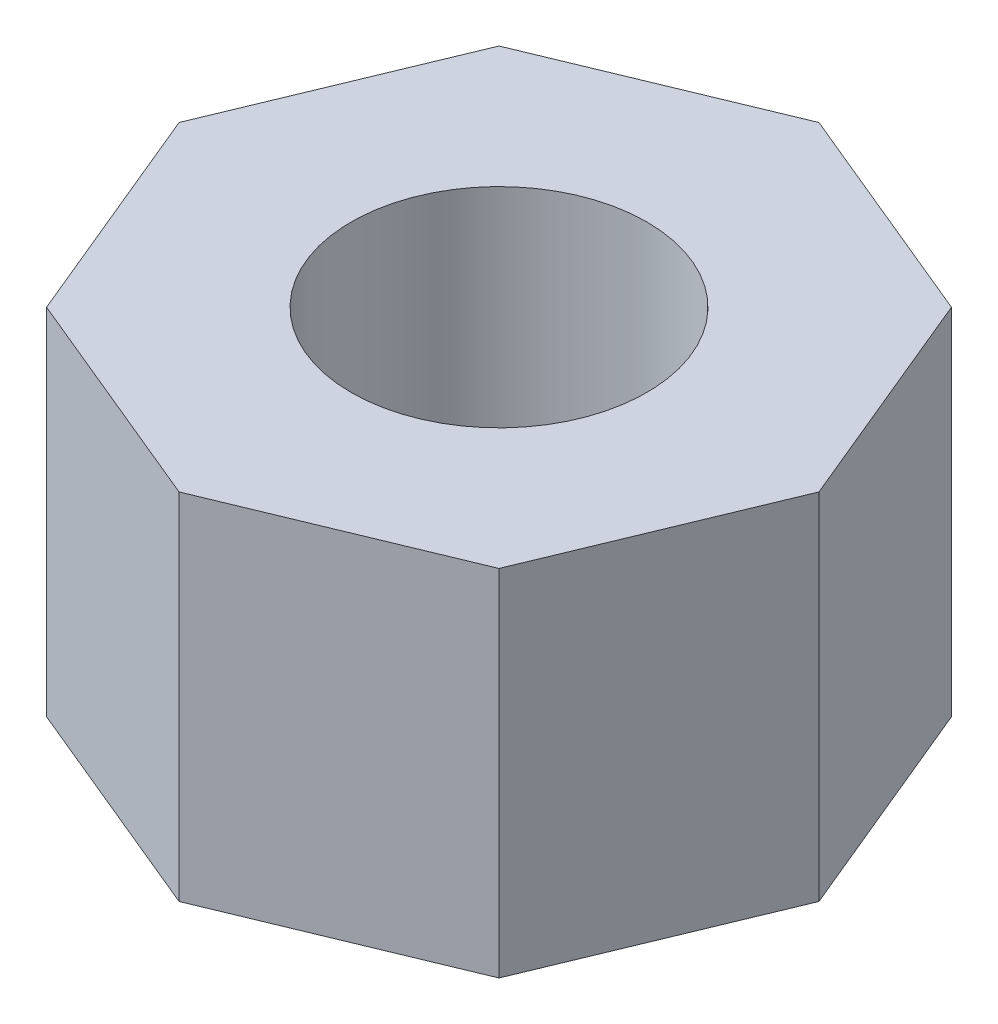
ISO-10303-21;
HEADER;
FILE_DESCRIPTION(('STEP AP214'),'2;1');
FILE_NAME('part.step','',(''),(''),'','','');
FILE_SCHEMA(('AUTOMOTIVE_DESIGN { 1 0 10303 214 1 1 1 1 }'));
ENDSEC;
DATA;
#1=APPLICATION_CONTEXT('core data for automotive mechanical design processes');
#2=APPLICATION_PROTOCOL_DEFINITION('international standard','automotive_design',2000,#1);
#3=PRODUCT_CONTEXT('',#1,'mechanical');
#4=PRODUCT('Part','Part','',(#3));
#5=PRODUCT_RELATED_PRODUCT_CATEGORY('part','',(#4));
#6=PRODUCT_DEFINITION_FORMATION('','',#4);
#7=PRODUCT_DEFINITION_CONTEXT('part definition',#1,'design');
#8=PRODUCT_DEFINITION('design','',#6,#7);
#9=PRODUCT_DEFINITION_SHAPE('','',#8);
#10=(LENGTH_UNIT() NAMED_UNIT(*) SI_UNIT(.MILLI.,.METRE.));
#11=(NAMED_UNIT(*) PLANE_ANGLE_UNIT() SI_UNIT($,.RADIAN.));
#12=(NAMED_UNIT(*) SI_UNIT($,.STERADIAN.) SOLID_ANGLE_UNIT());
#13=UNCERTAINTY_MEASURE_WITH_UNIT(LENGTH_MEASURE(1.E-05),#10,'distance_accuracy_value','');
#14=(GEOMETRIC_REPRESENTATION_CONTEXT(3) GLOBAL_UNCERTAINTY_ASSIGNED_CONTEXT((#13)) GLOBAL_UNIT_ASSIGNED_CONTEXT((#10,
#11,#12)) REPRESENTATION_CONTEXT('',''));
#15=CARTESIAN_POINT('',(0.,0.,0.));
#16=DIRECTION('',(0.,0.,1.));
#17=DIRECTION('',(1.,0.,0.));
#18=AXIS2_PLACEMENT_3D('',#15,#16,#17);
#19=CARTESIAN_POINT('',(1.9134171618255,6.,4.61939766255641));
#20=DIRECTION('',(-0.382683432365101,0.,-0.923879532511282));
#21=DIRECTION('',(-0.923879532511282,0.,0.382683432365101));
#22=AXIS2_PLACEMENT_3D('',#19,#20,#21);
#23=PLANE('',#22);
#24=DIRECTION('',(0.923879532511282,0.,-0.382683432365101));
#25=VECTOR('',#24,1.);
#26=CARTESIAN_POINT('',(1.9134171618255,0.,4.61939766255641));
#27=LINE('',#26,#25);
#28=CARTESIAN_POINT('',(0.,0.,5.41196100146197));
#29=VERTEX_POINT('',#28);
#30=CARTESIAN_POINT('',(3.82683432365094,0.,3.82683432365086));
#31=VERTEX_POINT('',#30);
#32=EDGE_CURVE('E135',#29,#31,#27,.T.);
#33=ORIENTED_EDGE('',*,*,#32,.T.);
#34=DIRECTION('',(0.,-1.,0.));
#35=VECTOR('',#34,1.);
#36=CARTESIAN_POINT('',(3.82683432365094,6.,3.82683432365086));
#37=LINE('',#36,#35);
#38=CARTESIAN_POINT('',(3.82683432365094,6.,3.82683432365086));
#39=VERTEX_POINT('',#38);
#40=EDGE_CURVE('E11',#39,#31,#37,.T.);
#41=ORIENTED_EDGE('',*,*,#40,.F.);
#42=DIRECTION('',(0.923879532511282,0.,-0.382683432365101));
#43=VECTOR('',#42,1.);
#44=CARTESIAN_POINT('',(1.9134171618255,6.,4.61939766255641));
#45=LINE('',#44,#43);
#46=CARTESIAN_POINT('',(0.,6.,5.41196100146197));
#47=VERTEX_POINT('',#46);
#48=EDGE_CURVE('E181',#47,#39,#45,.T.);
#49=ORIENTED_EDGE('',*,*,#48,.F.);
#50=DIRECTION('',(0.,-1.,0.));
#51=VECTOR('',#50,1.);
#52=CARTESIAN_POINT('',(0.,6.,5.41196100146197));
#53=LINE('',#52,#51);
#54=EDGE_CURVE('E128',#47,#29,#53,.T.);
#55=ORIENTED_EDGE('',*,*,#54,.T.);
#56=EDGE_LOOP('',(#33,#41,#49,#55));
#57=FACE_BOUND('',#56,.T.);
#58=ADVANCED_FACE('F35',(#57),#23,.F.);
#59=CARTESIAN_POINT('',(4.61939766255646,6.,1.9134171618254));
#60=DIRECTION('',(-0.923879532511291,0.,-0.382683432365079));
#61=DIRECTION('',(-0.382683432365079,0.,0.923879532511291));
#62=AXIS2_PLACEMENT_3D('',#59,#60,#61);
#63=PLANE('',#62);
#64=DIRECTION('',(0.382683432365079,0.,-0.923879532511291));
#65=VECTOR('',#64,1.);
#66=CARTESIAN_POINT('',(4.61939766255646,0.,1.9134171618254));
#67=LINE('',#66,#65);
#68=CARTESIAN_POINT('',(5.41196100146197,0.,0.));
#69=VERTEX_POINT('',#68);
#70=EDGE_CURVE('E138',#31,#69,#67,.T.);
#71=ORIENTED_EDGE('',*,*,#70,.T.);
#72=DIRECTION('',(0.,-1.,0.));
#73=VECTOR('',#72,1.);
#74=CARTESIAN_POINT('',(5.41196100146197,6.,0.));
#75=LINE('',#74,#73);
#76=CARTESIAN_POINT('',(5.41196100146197,6.,0.));
#77=VERTEX_POINT('',#76);
#78=EDGE_CURVE('E44',#77,#69,#75,.T.);
#79=ORIENTED_EDGE('',*,*,#78,.F.);
#80=DIRECTION('',(0.382683432365079,0.,-0.923879532511291));
#81=VECTOR('',#80,1.);
#82=CARTESIAN_POINT('',(4.61939766255646,6.,1.9134171618254));
#83=LINE('',#82,#81);
#84=EDGE_CURVE('E95',#39,#77,#83,.T.);
#85=ORIENTED_EDGE('',*,*,#84,.F.);
#86=ORIENTED_EDGE('',*,*,#40,.T.);
#87=EDGE_LOOP('',(#71,#79,#85,#86));
#88=FACE_BOUND('',#87,.T.);
#89=ADVANCED_FACE('F199',(#88),#63,.F.);
#90=CARTESIAN_POINT('',(4.61939766255641,6.,-1.9134171618255));
#91=DIRECTION('',(-0.923879532511282,0.,0.3826834323651));
#92=DIRECTION('',(0.3826834323651,0.,0.923879532511283));
#93=AXIS2_PLACEMENT_3D('',#90,#91,#92);
#94=PLANE('',#93);
#95=DIRECTION('',(-0.3826834323651,0.,-0.923879532511282));
#96=VECTOR('',#95,1.);
#97=CARTESIAN_POINT('',(4.61939766255641,0.,-1.9134171618255));
#98=LINE('',#97,#96);
#99=CARTESIAN_POINT('',(3.82683432365085,0.,-3.82683432365095));
#100=VERTEX_POINT('',#99);
#101=EDGE_CURVE('E140',#69,#100,#98,.T.);
#102=ORIENTED_EDGE('',*,*,#101,.T.);
#103=DIRECTION('',(0.,-1.,0.));
#104=VECTOR('',#103,1.);
#105=CARTESIAN_POINT('',(3.82683432365085,6.,-3.82683432365095));
#106=LINE('',#105,#104);
#107=CARTESIAN_POINT('',(3.82683432365085,6.,-3.82683432365095));
#108=VERTEX_POINT('',#107);
#109=EDGE_CURVE('E156',#108,#100,#106,.T.);
#110=ORIENTED_EDGE('',*,*,#109,.F.);
#111=DIRECTION('',(-0.3826834323651,0.,-0.923879532511282));
#112=VECTOR('',#111,1.);
#113=CARTESIAN_POINT('',(4.61939766255641,6.,-1.9134171618255));
#114=LINE('',#113,#112);
#115=EDGE_CURVE('E164',#77,#108,#114,.T.);
#116=ORIENTED_EDGE('',*,*,#115,.F.);
#117=ORIENTED_EDGE('',*,*,#78,.T.);
#118=EDGE_LOOP('',(#102,#110,#116,#117));
#119=FACE_BOUND('',#118,.T.);
#120=ADVANCED_FACE('F162',(#119),#94,.F.);
#121=CARTESIAN_POINT('',(1.9134171618254,6.,-4.61939766255646));
#122=DIRECTION('',(-0.382683432365079,0.,0.923879532511291));
#123=DIRECTION('',(0.923879532511291,0.,0.382683432365079));
#124=AXIS2_PLACEMENT_3D('',#121,#122,#123);
#125=PLANE('',#124);
#126=DIRECTION('',(-0.923879532511291,0.,-0.382683432365079));
#127=VECTOR('',#126,1.);
#128=CARTESIAN_POINT('',(1.9134171618254,0.,-4.61939766255646));
#129=LINE('',#128,#127);
#130=CARTESIAN_POINT('',(0.,0.,-5.41196100146197));
#131=VERTEX_POINT('',#130);
#132=EDGE_CURVE('E142',#100,#131,#129,.T.);
#133=ORIENTED_EDGE('',*,*,#132,.T.);
#134=DIRECTION('',(0.,-1.,0.));
#135=VECTOR('',#134,1.);
#136=CARTESIAN_POINT('',(0.,6.,-5.41196100146197));
#137=LINE('',#136,#135);
#138=CARTESIAN_POINT('',(0.,6.,-5.41196100146197));
#139=VERTEX_POINT('',#138);
#140=EDGE_CURVE('E153',#139,#131,#137,.T.);
#141=ORIENTED_EDGE('',*,*,#140,.F.);
#142=DIRECTION('',(-0.923879532511291,0.,-0.382683432365079));
#143=VECTOR('',#142,1.);
#144=CARTESIAN_POINT('',(1.9134171618254,6.,-4.61939766255646));
#145=LINE('',#144,#143);
#146=EDGE_CURVE('E176',#108,#139,#145,.T.);
#147=ORIENTED_EDGE('',*,*,#146,.F.);
#148=ORIENTED_EDGE('',*,*,#109,.T.);
#149=EDGE_LOOP('',(#133,#141,#147,#148));
#150=FACE_BOUND('',#149,.T.);
#151=ADVANCED_FACE('F172',(#150),#125,.F.);
#152=CARTESIAN_POINT('',(-1.9134171618255,6.,-4.61939766255641));
#153=DIRECTION('',(0.3826834323651,0.,0.923879532511282));
#154=DIRECTION('',(0.923879532511283,0.,-0.3826834323651));
#155=AXIS2_PLACEMENT_3D('',#152,#153,#154);
#156=PLANE('',#155);
#157=DIRECTION('',(-0.923879532511282,0.,0.3826834323651));
#158=VECTOR('',#157,1.);
#159=CARTESIAN_POINT('',(-1.9134171618255,0.,-4.61939766255641));
#160=LINE('',#159,#158);
#161=CARTESIAN_POINT('',(-3.82683432365094,0.,-3.82683432365086));
#162=VERTEX_POINT('',#161);
#163=EDGE_CURVE('E144',#131,#162,#160,.T.);
#164=ORIENTED_EDGE('',*,*,#163,.T.);
#165=DIRECTION('',(0.,-1.,0.));
#166=VECTOR('',#165,1.);
#167=CARTESIAN_POINT('',(-3.82683432365094,6.,-3.82683432365086));
#168=LINE('',#167,#166);
#169=CARTESIAN_POINT('',(-3.82683432365094,6.,-3.82683432365086));
#170=VERTEX_POINT('',#169);
#171=EDGE_CURVE('E123',#170,#162,#168,.T.);
#172=ORIENTED_EDGE('',*,*,#171,.F.);
#173=DIRECTION('',(-0.923879532511282,0.,0.3826834323651));
#174=VECTOR('',#173,1.);
#175=CARTESIAN_POINT('',(-1.9134171618255,6.,-4.61939766255641));
#176=LINE('',#175,#174);
#177=EDGE_CURVE('E114',#139,#170,#176,.T.);
#178=ORIENTED_EDGE('',*,*,#177,.F.);
#179=ORIENTED_EDGE('',*,*,#140,.T.);
#180=EDGE_LOOP('',(#164,#172,#178,#179));
#181=FACE_BOUND('',#180,.T.);
#182=ADVANCED_FACE('F175',(#181),#156,.F.);
#183=CARTESIAN_POINT('',(-4.61939766255646,6.,-1.9134171618254));
#184=DIRECTION('',(0.923879532511291,0.,0.382683432365079));
#185=DIRECTION('',(0.382683432365079,0.,-0.923879532511291));
#186=AXIS2_PLACEMENT_3D('',#183,#184,#185);
#187=PLANE('',#186);
#188=DIRECTION('',(-0.382683432365079,0.,0.923879532511291));
#189=VECTOR('',#188,1.);
#190=CARTESIAN_POINT('',(-4.61939766255646,0.,-1.9134171618254));
#191=LINE('',#190,#189);
#192=CARTESIAN_POINT('',(-5.41196100146197,0.,0.));
#193=VERTEX_POINT('',#192);
#194=EDGE_CURVE('E122',#162,#193,#191,.T.);
#195=ORIENTED_EDGE('',*,*,#194,.T.);
#196=DIRECTION('',(0.,-1.,0.));
#197=VECTOR('',#196,1.);
#198=CARTESIAN_POINT('',(-5.41196100146197,6.,0.));
#199=LINE('',#198,#197);
#200=CARTESIAN_POINT('',(-5.41196100146197,6.,0.));
#201=VERTEX_POINT('',#200);
#202=EDGE_CURVE('E119',#201,#193,#199,.T.);
#203=ORIENTED_EDGE('',*,*,#202,.F.);
#204=DIRECTION('',(-0.382683432365079,0.,0.923879532511291));
#205=VECTOR('',#204,1.);
#206=CARTESIAN_POINT('',(-4.61939766255646,6.,-1.9134171618254));
#207=LINE('',#206,#205);
#208=EDGE_CURVE('E108',#170,#201,#207,.T.);
#209=ORIENTED_EDGE('',*,*,#208,.F.);
#210=ORIENTED_EDGE('',*,*,#171,.T.);
#211=EDGE_LOOP('',(#195,#203,#209,#210));
#212=FACE_BOUND('',#211,.T.);
#213=ADVANCED_FACE('F120',(#212),#187,.F.);
#214=CARTESIAN_POINT('',(-4.61939766255641,6.,1.9134171618255));
#215=DIRECTION('',(0.923879532511282,0.,-0.3826834323651));
#216=DIRECTION('',(-0.3826834323651,0.,-0.923879532511283));
#217=AXIS2_PLACEMENT_3D('',#214,#215,#216);
#218=PLANE('',#217);
#219=DIRECTION('',(0.3826834323651,0.,0.923879532511282));
#220=VECTOR('',#219,1.);
#221=CARTESIAN_POINT('',(-4.61939766255641,0.,1.9134171618255));
#222=LINE('',#221,#220);
#223=CARTESIAN_POINT('',(-3.82683432365086,0.,3.82683432365094));
#224=VERTEX_POINT('',#223);
#225=EDGE_CURVE('E81',#193,#224,#222,.T.);
#226=ORIENTED_EDGE('',*,*,#225,.T.);
#227=DIRECTION('',(0.,-1.,0.));
#228=VECTOR('',#227,1.);
#229=CARTESIAN_POINT('',(-3.82683432365086,6.,3.82683432365094));
#230=LINE('',#229,#228);
#231=CARTESIAN_POINT('',(-3.82683432365086,6.,3.82683432365094));
#232=VERTEX_POINT('',#231);
#233=EDGE_CURVE('E124',#232,#224,#230,.T.);
#234=ORIENTED_EDGE('',*,*,#233,.F.);
#235=DIRECTION('',(0.3826834323651,0.,0.923879532511282));
#236=VECTOR('',#235,1.);
#237=CARTESIAN_POINT('',(-4.61939766255641,6.,1.9134171618255));
#238=LINE('',#237,#236);
#239=EDGE_CURVE('E112',#201,#232,#238,.T.);
#240=ORIENTED_EDGE('',*,*,#239,.F.);
#241=ORIENTED_EDGE('',*,*,#202,.T.);
#242=EDGE_LOOP('',(#226,#234,#240,#241));
#243=FACE_BOUND('',#242,.T.);
#244=ADVANCED_FACE('F126',(#243),#218,.F.);
#245=CARTESIAN_POINT('',(0.,6.,0.));
#246=DIRECTION('',(0.,-1.,0.));
#247=DIRECTION('',(0.,0.,-1.));
#248=AXIS2_PLACEMENT_3D('',#245,#246,#247);
#249=CYLINDRICAL_SURFACE('',#248,2.5);
#250=CARTESIAN_POINT('',(0.,6.,0.));
#251=DIRECTION('',(0.,1.,0.));
#252=DIRECTION('',(0.,0.,1.));
#253=AXIS2_PLACEMENT_3D('',#250,#251,#252);
#254=CIRCLE('',#253,2.5);
#255=CARTESIAN_POINT('',(0.,6.,2.5));
#256=VERTEX_POINT('',#255);
#257=EDGE_CURVE('E149',#256,#256,#254,.T.);
#258=ORIENTED_EDGE('',*,*,#257,.T.);
#259=EDGE_LOOP('',(#258));
#260=FACE_BOUND('',#259,.T.);
#261=CARTESIAN_POINT('',(0.,0.,0.));
#262=DIRECTION('',(0.,1.,0.));
#263=DIRECTION('',(0.,0.,1.));
#264=AXIS2_PLACEMENT_3D('',#261,#262,#263);
#265=CIRCLE('',#264,2.5);
#266=CARTESIAN_POINT('',(0.,0.,2.5));
#267=VERTEX_POINT('',#266);
#268=EDGE_CURVE('E132',#267,#267,#265,.T.);
#269=ORIENTED_EDGE('',*,*,#268,.F.);
#270=EDGE_LOOP('',(#269));
#271=FACE_BOUND('',#270,.T.);
#272=ADVANCED_FACE('F37',(#260,#271),#249,.F.);
#273=CARTESIAN_POINT('',(-1.91341716182539,6.,4.61939766255646));
#274=DIRECTION('',(0.382683432365079,0.,-0.923879532511291));
#275=DIRECTION('',(-0.923879532511291,0.,-0.382683432365079));
#276=AXIS2_PLACEMENT_3D('',#273,#274,#275);
#277=PLANE('',#276);
#278=DIRECTION('',(0.923879532511291,0.,0.382683432365079));
#279=VECTOR('',#278,1.);
#280=CARTESIAN_POINT('',(-1.91341716182539,0.,4.61939766255646));
#281=LINE('',#280,#279);
#282=EDGE_CURVE('E87',#224,#29,#281,.T.);
#283=ORIENTED_EDGE('',*,*,#282,.T.);
#284=ORIENTED_EDGE('',*,*,#54,.F.);
#285=DIRECTION('',(0.923879532511291,0.,0.382683432365079));
#286=VECTOR('',#285,1.);
#287=CARTESIAN_POINT('',(-1.91341716182539,6.,4.61939766255646));
#288=LINE('',#287,#286);
#289=EDGE_CURVE('E52',#232,#47,#288,.T.);
#290=ORIENTED_EDGE('',*,*,#289,.F.);
#291=ORIENTED_EDGE('',*,*,#233,.T.);
#292=EDGE_LOOP('',(#283,#284,#290,#291));
#293=FACE_BOUND('',#292,.T.);
#294=ADVANCED_FACE('F189',(#293),#277,.F.);
#295=CARTESIAN_POINT('',(0.,6.,0.));
#296=DIRECTION('',(0.,1.,0.));
#297=DIRECTION('',(0.,0.,1.));
#298=AXIS2_PLACEMENT_3D('',#295,#296,#297);
#299=PLANE('',#298);
#300=ORIENTED_EDGE('',*,*,#257,.F.);
#301=EDGE_LOOP('',(#300));
#302=FACE_BOUND('',#301,.T.);
#303=ORIENTED_EDGE('',*,*,#48,.T.);
#304=ORIENTED_EDGE('',*,*,#84,.T.);
#305=ORIENTED_EDGE('',*,*,#115,.T.);
#306=ORIENTED_EDGE('',*,*,#146,.T.);
#307=ORIENTED_EDGE('',*,*,#177,.T.);
#308=ORIENTED_EDGE('',*,*,#208,.T.);
#309=ORIENTED_EDGE('',*,*,#239,.T.);
#310=ORIENTED_EDGE('',*,*,#289,.T.);
#311=EDGE_LOOP('',(#303,#304,#305,#306,#307,#308,#309,#310));
#312=FACE_BOUND('',#311,.T.);
#313=ADVANCED_FACE('F110',(#302,#312),#299,.T.);
#314=CARTESIAN_POINT('',(0.,0.,0.));
#315=DIRECTION('',(0.,1.,0.));
#316=DIRECTION('',(0.,0.,1.));
#317=AXIS2_PLACEMENT_3D('',#314,#315,#316);
#318=PLANE('',#317);
#319=ORIENTED_EDGE('',*,*,#268,.T.);
#320=EDGE_LOOP('',(#319));
#321=FACE_BOUND('',#320,.T.);
#322=ORIENTED_EDGE('',*,*,#32,.F.);
#323=ORIENTED_EDGE('',*,*,#282,.F.);
#324=ORIENTED_EDGE('',*,*,#225,.F.);
#325=ORIENTED_EDGE('',*,*,#194,.F.);
#326=ORIENTED_EDGE('',*,*,#163,.F.);
#327=ORIENTED_EDGE('',*,*,#132,.F.);
#328=ORIENTED_EDGE('',*,*,#101,.F.);
#329=ORIENTED_EDGE('',*,*,#70,.F.);
#330=EDGE_LOOP('',(#322,#323,#324,#325,#326,#327,#328,#329));
#331=FACE_BOUND('',#330,.T.);
#332=ADVANCED_FACE('F168',(#321,#331),#318,.F.);
#333=CLOSED_SHELL('',(#58,#89,#120,#151,#182,#213,#244,#272,#294,#313,#332));
#334=MANIFOLD_SOLID_BREP('B2',#333);
#335=ADVANCED_BREP_SHAPE_REPRESENTATION('',(#18,#334),#14);
#336=SHAPE_DEFINITION_REPRESENTATION(#9,#335);
ENDSEC;
END-ISO-10303-21;
